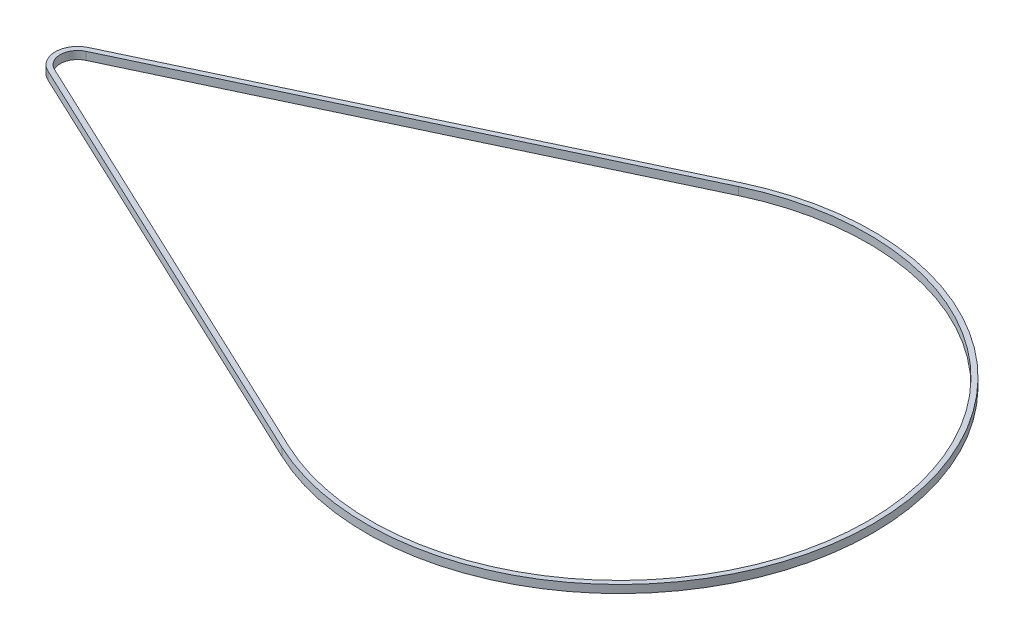
ISO-10303-21;
HEADER;
FILE_DESCRIPTION(('STEP AP214'),'2;1');
FILE_NAME('part.step','',(''),(''),'','','');
FILE_SCHEMA(('AUTOMOTIVE_DESIGN { 1 0 10303 214 1 1 1 1 }'));
ENDSEC;
DATA;
#1=APPLICATION_CONTEXT('core data for automotive mechanical design processes');
#2=APPLICATION_PROTOCOL_DEFINITION('international standard','automotive_design',2000,#1);
#3=PRODUCT_CONTEXT('',#1,'mechanical');
#4=PRODUCT('Part','Part','',(#3));
#5=PRODUCT_RELATED_PRODUCT_CATEGORY('part','',(#4));
#6=PRODUCT_DEFINITION_FORMATION('','',#4);
#7=PRODUCT_DEFINITION_CONTEXT('part definition',#1,'design');
#8=PRODUCT_DEFINITION('design','',#6,#7);
#9=PRODUCT_DEFINITION_SHAPE('','',#8);
#10=(LENGTH_UNIT() NAMED_UNIT(*) SI_UNIT(.MILLI.,.METRE.));
#11=(NAMED_UNIT(*) PLANE_ANGLE_UNIT() SI_UNIT($,.RADIAN.));
#12=(NAMED_UNIT(*) SI_UNIT($,.STERADIAN.) SOLID_ANGLE_UNIT());
#13=UNCERTAINTY_MEASURE_WITH_UNIT(LENGTH_MEASURE(1.E-05),#10,'distance_accuracy_value','');
#14=(GEOMETRIC_REPRESENTATION_CONTEXT(3) GLOBAL_UNCERTAINTY_ASSIGNED_CONTEXT((#13)) GLOBAL_UNIT_ASSIGNED_CONTEXT((#10,
#11,#12)) REPRESENTATION_CONTEXT('',''));
#15=CARTESIAN_POINT('',(0.,0.,0.));
#16=DIRECTION('',(0.,0.,1.));
#17=DIRECTION('',(1.,0.,0.));
#18=AXIS2_PLACEMENT_3D('',#15,#16,#17);
#19=CARTESIAN_POINT('',(0.,3.175,0.));
#20=DIRECTION('',(0.,1.,0.));
#21=DIRECTION('',(0.,0.,1.));
#22=AXIS2_PLACEMENT_3D('',#19,#20,#21);
#23=PLANE('',#22);
#24=CARTESIAN_POINT('',(0.,3.175,0.));
#25=DIRECTION('',(0.,1.,0.));
#26=DIRECTION('',(0.,0.,1.));
#27=AXIS2_PLACEMENT_3D('',#24,#25,#26);
#28=CIRCLE('',#27,102.);
#29=CARTESIAN_POINT('',(-43.5137614678899,3.175,92.2526561293256));
#30=VERTEX_POINT('',#29);
#31=CARTESIAN_POINT('',(-43.51376146789,3.175,-92.2526561293256));
#32=VERTEX_POINT('',#31);
#33=EDGE_CURVE('E140',#30,#32,#28,.T.);
#34=ORIENTED_EDGE('',*,*,#33,.T.);
#35=DIRECTION('',(-0.904437805189467,0.,0.426605504587156));
#36=VECTOR('',#35,1.);
#37=CARTESIAN_POINT('',(-43.51376146789,3.175,-92.2526561293256));
#38=LINE('',#37,#36);
#39=CARTESIAN_POINT('',(-221.839449541285,3.175,-8.13994024670518));
#40=VERTEX_POINT('',#39);
#41=EDGE_CURVE('E143',#32,#40,#38,.T.);
#42=ORIENTED_EDGE('',*,*,#41,.T.);
#43=CARTESIAN_POINT('',(-218.,3.175,0.));
#44=DIRECTION('',(0.,1.,0.));
#45=DIRECTION('',(0.,0.,1.));
#46=AXIS2_PLACEMENT_3D('',#43,#44,#45);
#47=CIRCLE('',#46,9.00000000000001);
#48=CARTESIAN_POINT('',(-221.839449541285,3.175,8.13994024670525));
#49=VERTEX_POINT('',#48);
#50=EDGE_CURVE('E146',#40,#49,#47,.T.);
#51=ORIENTED_EDGE('',*,*,#50,.T.);
#52=DIRECTION('',(0.904437805189467,0.,0.426605504587156));
#53=VECTOR('',#52,1.);
#54=CARTESIAN_POINT('',(-221.839449541285,3.175,8.13994024670522));
#55=LINE('',#54,#53);
#56=EDGE_CURVE('E148',#49,#30,#55,.T.);
#57=ORIENTED_EDGE('',*,*,#56,.T.);
#58=EDGE_LOOP('',(#34,#42,#51,#57));
#59=FACE_BOUND('',#58,.T.);
#60=DIRECTION('',(-0.904437805189467,0.,0.426605504587157));
#61=VECTOR('',#60,1.);
#62=CARTESIAN_POINT('',(-42.6605504587157,3.175,-90.4437805189467));
#63=LINE('',#62,#61);
#64=CARTESIAN_POINT('',(-42.6605504587157,3.175,-90.4437805189467));
#65=VERTEX_POINT('',#64);
#66=CARTESIAN_POINT('',(-220.98623853211,3.175,-6.33106463632625));
#67=VERTEX_POINT('',#66);
#68=EDGE_CURVE('E112',#65,#67,#63,.T.);
#69=ORIENTED_EDGE('',*,*,#68,.F.);
#70=CARTESIAN_POINT('',(0.,3.175,0.));
#71=DIRECTION('',(0.,1.,0.));
#72=DIRECTION('',(0.,0.,1.));
#73=AXIS2_PLACEMENT_3D('',#70,#71,#72);
#74=CIRCLE('',#73,100.);
#75=CARTESIAN_POINT('',(-42.6605504587156,3.175,90.4437805189467));
#76=VERTEX_POINT('',#75);
#77=EDGE_CURVE('E104',#76,#65,#74,.T.);
#78=ORIENTED_EDGE('',*,*,#77,.F.);
#79=DIRECTION('',(0.904437805189467,0.,0.426605504587156));
#80=VECTOR('',#79,1.);
#81=CARTESIAN_POINT('',(-220.98623853211,3.175,6.33106463632629));
#82=LINE('',#81,#80);
#83=CARTESIAN_POINT('',(-220.98623853211,3.175,6.33106463632629));
#84=VERTEX_POINT('',#83);
#85=EDGE_CURVE('E126',#84,#76,#82,.T.);
#86=ORIENTED_EDGE('',*,*,#85,.F.);
#87=CARTESIAN_POINT('',(-218.,3.175,0.));
#88=DIRECTION('',(0.,1.,0.));
#89=DIRECTION('',(0.,0.,1.));
#90=AXIS2_PLACEMENT_3D('',#87,#88,#89);
#91=CIRCLE('',#90,7.);
#92=EDGE_CURVE('E124',#67,#84,#91,.T.);
#93=ORIENTED_EDGE('',*,*,#92,.F.);
#94=EDGE_LOOP('',(#69,#78,#86,#93));
#95=FACE_BOUND('',#94,.T.);
#96=ADVANCED_FACE('F39',(#59,#95),#23,.T.);
#97=CARTESIAN_POINT('',(0.,0.,0.));
#98=DIRECTION('',(0.,1.,0.));
#99=DIRECTION('',(0.,0.,1.));
#100=AXIS2_PLACEMENT_3D('',#97,#98,#99);
#101=PLANE('',#100);
#102=CARTESIAN_POINT('',(0.,0.,0.));
#103=DIRECTION('',(0.,1.,0.));
#104=DIRECTION('',(0.,0.,1.));
#105=AXIS2_PLACEMENT_3D('',#102,#103,#104);
#106=CIRCLE('',#105,102.);
#107=CARTESIAN_POINT('',(-43.5137614678899,0.,92.2526561293256));
#108=VERTEX_POINT('',#107);
#109=CARTESIAN_POINT('',(-43.51376146789,0.,-92.2526561293256));
#110=VERTEX_POINT('',#109);
#111=EDGE_CURVE('E120',#108,#110,#106,.T.);
#112=ORIENTED_EDGE('',*,*,#111,.F.);
#113=DIRECTION('',(0.904437805189467,0.,0.426605504587156));
#114=VECTOR('',#113,1.);
#115=CARTESIAN_POINT('',(-221.839449541285,0.,8.13994024670522));
#116=LINE('',#115,#114);
#117=CARTESIAN_POINT('',(-221.839449541285,0.,8.13994024670525));
#118=VERTEX_POINT('',#117);
#119=EDGE_CURVE('E144',#118,#108,#116,.T.);
#120=ORIENTED_EDGE('',*,*,#119,.F.);
#121=CARTESIAN_POINT('',(-218.,0.,0.));
#122=DIRECTION('',(0.,1.,0.));
#123=DIRECTION('',(0.,0.,1.));
#124=AXIS2_PLACEMENT_3D('',#121,#122,#123);
#125=CIRCLE('',#124,9.00000000000001);
#126=CARTESIAN_POINT('',(-221.839449541285,0.,-8.13994024670518));
#127=VERTEX_POINT('',#126);
#128=EDGE_CURVE('E155',#127,#118,#125,.T.);
#129=ORIENTED_EDGE('',*,*,#128,.F.);
#130=DIRECTION('',(-0.904437805189467,0.,0.426605504587156));
#131=VECTOR('',#130,1.);
#132=CARTESIAN_POINT('',(-43.51376146789,0.,-92.2526561293256));
#133=LINE('',#132,#131);
#134=EDGE_CURVE('E153',#110,#127,#133,.T.);
#135=ORIENTED_EDGE('',*,*,#134,.F.);
#136=EDGE_LOOP('',(#112,#120,#129,#135));
#137=FACE_BOUND('',#136,.T.);
#138=CARTESIAN_POINT('',(0.,0.,0.));
#139=DIRECTION('',(0.,1.,0.));
#140=DIRECTION('',(0.,0.,1.));
#141=AXIS2_PLACEMENT_3D('',#138,#139,#140);
#142=CIRCLE('',#141,100.);
#143=CARTESIAN_POINT('',(-42.6605504587156,0.,90.4437805189467));
#144=VERTEX_POINT('',#143);
#145=CARTESIAN_POINT('',(-42.6605504587157,0.,-90.4437805189467));
#146=VERTEX_POINT('',#145);
#147=EDGE_CURVE('E62',#144,#146,#142,.T.);
#148=ORIENTED_EDGE('',*,*,#147,.T.);
#149=DIRECTION('',(-0.904437805189467,0.,0.426605504587157));
#150=VECTOR('',#149,1.);
#151=CARTESIAN_POINT('',(-42.6605504587157,0.,-90.4437805189467));
#152=LINE('',#151,#150);
#153=CARTESIAN_POINT('',(-220.98623853211,0.,-6.33106463632625));
#154=VERTEX_POINT('',#153);
#155=EDGE_CURVE('E119',#146,#154,#152,.T.);
#156=ORIENTED_EDGE('',*,*,#155,.T.);
#157=CARTESIAN_POINT('',(-218.,0.,0.));
#158=DIRECTION('',(0.,1.,0.));
#159=DIRECTION('',(0.,0.,1.));
#160=AXIS2_PLACEMENT_3D('',#157,#158,#159);
#161=CIRCLE('',#160,7.);
#162=CARTESIAN_POINT('',(-220.98623853211,0.,6.3310646363263));
#163=VERTEX_POINT('',#162);
#164=EDGE_CURVE('E132',#154,#163,#161,.T.);
#165=ORIENTED_EDGE('',*,*,#164,.T.);
#166=DIRECTION('',(0.904437805189467,0.,0.426605504587156));
#167=VECTOR('',#166,1.);
#168=CARTESIAN_POINT('',(-220.98623853211,0.,6.33106463632629));
#169=LINE('',#168,#167);
#170=EDGE_CURVE('E113',#163,#144,#169,.T.);
#171=ORIENTED_EDGE('',*,*,#170,.T.);
#172=EDGE_LOOP('',(#148,#156,#165,#171));
#173=FACE_BOUND('',#172,.T.);
#174=ADVANCED_FACE('F173',(#137,#173),#101,.F.);
#175=CARTESIAN_POINT('',(0.,3.175,0.));
#176=DIRECTION('',(0.,-1.,0.));
#177=DIRECTION('',(0.,0.,-1.));
#178=AXIS2_PLACEMENT_3D('',#175,#176,#177);
#179=CYLINDRICAL_SURFACE('',#178,102.);
#180=ORIENTED_EDGE('',*,*,#111,.T.);
#181=DIRECTION('',(0.,-1.,0.));
#182=VECTOR('',#181,1.);
#183=CARTESIAN_POINT('',(-43.51376146789,3.175,-92.2526561293256));
#184=LINE('',#183,#182);
#185=EDGE_CURVE('E11',#32,#110,#184,.T.);
#186=ORIENTED_EDGE('',*,*,#185,.F.);
#187=ORIENTED_EDGE('',*,*,#33,.F.);
#188=DIRECTION('',(0.,-1.,0.));
#189=VECTOR('',#188,1.);
#190=CARTESIAN_POINT('',(-43.5137614678899,3.175,92.2526561293256));
#191=LINE('',#190,#189);
#192=EDGE_CURVE('E150',#30,#108,#191,.T.);
#193=ORIENTED_EDGE('',*,*,#192,.T.);
#194=EDGE_LOOP('',(#180,#186,#187,#193));
#195=FACE_BOUND('',#194,.T.);
#196=ADVANCED_FACE('F41',(#195),#179,.T.);
#197=CARTESIAN_POINT('',(-43.51376146789,3.175,-92.2526561293256));
#198=DIRECTION('',(0.426605504587157,0.,0.904437805189467));
#199=DIRECTION('',(0.904437805189467,0.,-0.426605504587157));
#200=AXIS2_PLACEMENT_3D('',#197,#198,#199);
#201=PLANE('',#200);
#202=ORIENTED_EDGE('',*,*,#134,.T.);
#203=DIRECTION('',(0.,-1.,0.));
#204=VECTOR('',#203,1.);
#205=CARTESIAN_POINT('',(-221.839449541285,3.175,-8.13994024670518));
#206=LINE('',#205,#204);
#207=EDGE_CURVE('E47',#40,#127,#206,.T.);
#208=ORIENTED_EDGE('',*,*,#207,.F.);
#209=ORIENTED_EDGE('',*,*,#41,.F.);
#210=ORIENTED_EDGE('',*,*,#185,.T.);
#211=EDGE_LOOP('',(#202,#208,#209,#210));
#212=FACE_BOUND('',#211,.T.);
#213=ADVANCED_FACE('F183',(#212),#201,.F.);
#214=CARTESIAN_POINT('',(-218.,3.175,0.));
#215=DIRECTION('',(0.,-1.,0.));
#216=DIRECTION('',(0.,0.,-1.));
#217=AXIS2_PLACEMENT_3D('',#214,#215,#216);
#218=CYLINDRICAL_SURFACE('',#217,9.00000000000001);
#219=ORIENTED_EDGE('',*,*,#128,.T.);
#220=DIRECTION('',(0.,-1.,0.));
#221=VECTOR('',#220,1.);
#222=CARTESIAN_POINT('',(-221.839449541285,3.175,8.13994024670525));
#223=LINE('',#222,#221);
#224=EDGE_CURVE('E160',#49,#118,#223,.T.);
#225=ORIENTED_EDGE('',*,*,#224,.F.);
#226=ORIENTED_EDGE('',*,*,#50,.F.);
#227=ORIENTED_EDGE('',*,*,#207,.T.);
#228=EDGE_LOOP('',(#219,#225,#226,#227));
#229=FACE_BOUND('',#228,.T.);
#230=ADVANCED_FACE('F167',(#229),#218,.T.);
#231=CARTESIAN_POINT('',(-221.839449541285,3.175,8.13994024670522));
#232=DIRECTION('',(0.426605504587156,0.,-0.904437805189467));
#233=DIRECTION('',(-0.904437805189467,0.,-0.426605504587156));
#234=AXIS2_PLACEMENT_3D('',#231,#232,#233);
#235=PLANE('',#234);
#236=ORIENTED_EDGE('',*,*,#119,.T.);
#237=ORIENTED_EDGE('',*,*,#192,.F.);
#238=ORIENTED_EDGE('',*,*,#56,.F.);
#239=ORIENTED_EDGE('',*,*,#224,.T.);
#240=EDGE_LOOP('',(#236,#237,#238,#239));
#241=FACE_BOUND('',#240,.T.);
#242=ADVANCED_FACE('F177',(#241),#235,.F.);
#243=CARTESIAN_POINT('',(0.,3.175,0.));
#244=DIRECTION('',(0.,-1.,0.));
#245=DIRECTION('',(0.,0.,-1.));
#246=AXIS2_PLACEMENT_3D('',#243,#244,#245);
#247=CYLINDRICAL_SURFACE('',#246,100.);
#248=ORIENTED_EDGE('',*,*,#147,.F.);
#249=DIRECTION('',(0.,-1.,0.));
#250=VECTOR('',#249,1.);
#251=CARTESIAN_POINT('',(-42.6605504587156,3.175,90.4437805189467));
#252=LINE('',#251,#250);
#253=EDGE_CURVE('E108',#76,#144,#252,.T.);
#254=ORIENTED_EDGE('',*,*,#253,.F.);
#255=ORIENTED_EDGE('',*,*,#77,.T.);
#256=DIRECTION('',(0.,-1.,0.));
#257=VECTOR('',#256,1.);
#258=CARTESIAN_POINT('',(-42.6605504587157,3.175,-90.4437805189467));
#259=LINE('',#258,#257);
#260=EDGE_CURVE('E107',#65,#146,#259,.T.);
#261=ORIENTED_EDGE('',*,*,#260,.T.);
#262=EDGE_LOOP('',(#248,#254,#255,#261));
#263=FACE_BOUND('',#262,.T.);
#264=ADVANCED_FACE('F106',(#263),#247,.F.);
#265=CARTESIAN_POINT('',(-42.6605504587157,3.175,-90.4437805189467));
#266=DIRECTION('',(0.426605504587156,0.,0.904437805189467));
#267=DIRECTION('',(0.904437805189467,0.,-0.426605504587156));
#268=AXIS2_PLACEMENT_3D('',#265,#266,#267);
#269=PLANE('',#268);
#270=ORIENTED_EDGE('',*,*,#155,.F.);
#271=ORIENTED_EDGE('',*,*,#260,.F.);
#272=ORIENTED_EDGE('',*,*,#68,.T.);
#273=DIRECTION('',(0.,-1.,0.));
#274=VECTOR('',#273,1.);
#275=CARTESIAN_POINT('',(-220.98623853211,3.175,-6.33106463632625));
#276=LINE('',#275,#274);
#277=EDGE_CURVE('E121',#67,#154,#276,.T.);
#278=ORIENTED_EDGE('',*,*,#277,.T.);
#279=EDGE_LOOP('',(#270,#271,#272,#278));
#280=FACE_BOUND('',#279,.T.);
#281=ADVANCED_FACE('F116',(#280),#269,.T.);
#282=CARTESIAN_POINT('',(-218.,3.175,0.));
#283=DIRECTION('',(0.,-1.,0.));
#284=DIRECTION('',(0.,0.,-1.));
#285=AXIS2_PLACEMENT_3D('',#282,#283,#284);
#286=CYLINDRICAL_SURFACE('',#285,7.);
#287=ORIENTED_EDGE('',*,*,#164,.F.);
#288=ORIENTED_EDGE('',*,*,#277,.F.);
#289=ORIENTED_EDGE('',*,*,#92,.T.);
#290=DIRECTION('',(0.,-1.,0.));
#291=VECTOR('',#290,1.);
#292=CARTESIAN_POINT('',(-220.98623853211,3.175,6.3310646363263));
#293=LINE('',#292,#291);
#294=EDGE_CURVE('E54',#84,#163,#293,.T.);
#295=ORIENTED_EDGE('',*,*,#294,.T.);
#296=EDGE_LOOP('',(#287,#288,#289,#295));
#297=FACE_BOUND('',#296,.T.);
#298=ADVANCED_FACE('F206',(#297),#286,.F.);
#299=CARTESIAN_POINT('',(-220.98623853211,3.175,6.33106463632629));
#300=DIRECTION('',(0.426605504587156,0.,-0.904437805189467));
#301=DIRECTION('',(-0.904437805189467,0.,-0.426605504587156));
#302=AXIS2_PLACEMENT_3D('',#299,#300,#301);
#303=PLANE('',#302);
#304=ORIENTED_EDGE('',*,*,#170,.F.);
#305=ORIENTED_EDGE('',*,*,#294,.F.);
#306=ORIENTED_EDGE('',*,*,#85,.T.);
#307=ORIENTED_EDGE('',*,*,#253,.T.);
#308=EDGE_LOOP('',(#304,#305,#306,#307));
#309=FACE_BOUND('',#308,.T.);
#310=ADVANCED_FACE('F210',(#309),#303,.T.);
#311=CLOSED_SHELL('',(#96,#174,#196,#213,#230,#242,#264,#281,#298,#310));
#312=MANIFOLD_SOLID_BREP('B2',#311);
#313=ADVANCED_BREP_SHAPE_REPRESENTATION('',(#18,#312),#14);
#314=SHAPE_DEFINITION_REPRESENTATION(#9,#313);
ENDSEC;
END-ISO-10303-21;
